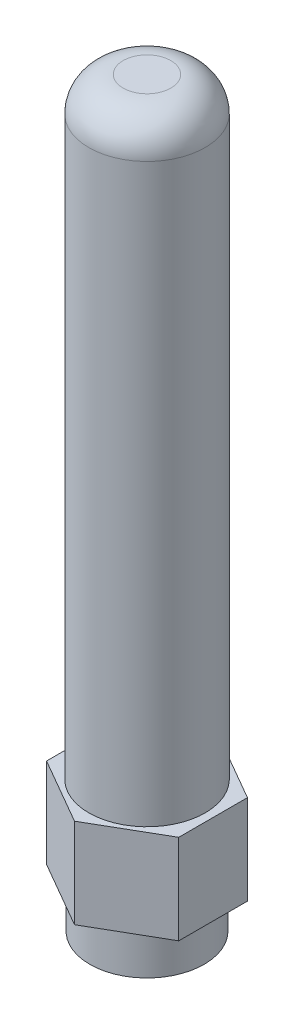
ISO-10303-21;
HEADER;
FILE_DESCRIPTION(('STEP AP214'),'2;1');
FILE_NAME('part.step','',(''),(''),'','','');
FILE_SCHEMA(('AUTOMOTIVE_DESIGN { 1 0 10303 214 1 1 1 1 }'));
ENDSEC;
DATA;
#1=APPLICATION_CONTEXT('core data for automotive mechanical design processes');
#2=APPLICATION_PROTOCOL_DEFINITION('international standard','automotive_design',2000,#1);
#3=PRODUCT_CONTEXT('',#1,'mechanical');
#4=PRODUCT('Part','Part','',(#3));
#5=PRODUCT_RELATED_PRODUCT_CATEGORY('part','',(#4));
#6=PRODUCT_DEFINITION_FORMATION('','',#4);
#7=PRODUCT_DEFINITION_CONTEXT('part definition',#1,'design');
#8=PRODUCT_DEFINITION('design','',#6,#7);
#9=PRODUCT_DEFINITION_SHAPE('','',#8);
#10=(LENGTH_UNIT() NAMED_UNIT(*) SI_UNIT(.MILLI.,.METRE.));
#11=(NAMED_UNIT(*) PLANE_ANGLE_UNIT() SI_UNIT($,.RADIAN.));
#12=(NAMED_UNIT(*) SI_UNIT($,.STERADIAN.) SOLID_ANGLE_UNIT());
#13=UNCERTAINTY_MEASURE_WITH_UNIT(LENGTH_MEASURE(1.E-05),#10,'distance_accuracy_value','');
#14=(GEOMETRIC_REPRESENTATION_CONTEXT(3) GLOBAL_UNCERTAINTY_ASSIGNED_CONTEXT((#13)) GLOBAL_UNIT_ASSIGNED_CONTEXT((#10,
#11,#12)) REPRESENTATION_CONTEXT('',''));
#15=CARTESIAN_POINT('',(0.,0.,0.));
#16=DIRECTION('',(0.,0.,1.));
#17=DIRECTION('',(1.,0.,0.));
#18=AXIS2_PLACEMENT_3D('',#15,#16,#17);
#19=CARTESIAN_POINT('',(0.,0.,0.));
#20=DIRECTION('',(0.,1.,0.));
#21=DIRECTION('',(0.,0.,1.));
#22=AXIS2_PLACEMENT_3D('',#19,#20,#21);
#23=PLANE('',#22);
#24=CARTESIAN_POINT('',(0.,0.,0.));
#25=DIRECTION('',(0.,1.,0.));
#26=DIRECTION('',(0.,0.,1.));
#27=AXIS2_PLACEMENT_3D('',#24,#25,#26);
#28=CIRCLE('',#27,3.81);
#29=CARTESIAN_POINT('',(0.,0.,3.81));
#30=VERTEX_POINT('',#29);
#31=EDGE_CURVE('E160',#30,#30,#28,.T.);
#32=ORIENTED_EDGE('',*,*,#31,.F.);
#33=EDGE_LOOP('',(#32));
#34=FACE_BOUND('',#33,.T.);
#35=CARTESIAN_POINT('',(0.,0.,0.));
#36=DIRECTION('',(0.,1.,0.));
#37=DIRECTION('',(0.,0.,1.));
#38=AXIS2_PLACEMENT_3D('',#35,#36,#37);
#39=CIRCLE('',#38,2.667);
#40=CARTESIAN_POINT('',(0.,0.,2.667));
#41=VERTEX_POINT('',#40);
#42=EDGE_CURVE('E157',#41,#41,#39,.T.);
#43=ORIENTED_EDGE('',*,*,#42,.T.);
#44=EDGE_LOOP('',(#43));
#45=FACE_BOUND('',#44,.T.);
#46=ADVANCED_FACE('F49',(#34,#45),#23,.F.);
#47=CARTESIAN_POINT('',(0.,2.794,0.));
#48=DIRECTION('',(0.,-1.,0.));
#49=DIRECTION('',(0.,0.,-1.));
#50=AXIS2_PLACEMENT_3D('',#47,#48,#49);
#51=CYLINDRICAL_SURFACE('',#50,3.81);
#52=CARTESIAN_POINT('',(0.,2.794,0.));
#53=DIRECTION('',(0.,1.,0.));
#54=DIRECTION('',(0.,0.,1.));
#55=AXIS2_PLACEMENT_3D('',#52,#53,#54);
#56=CIRCLE('',#55,3.81);
#57=CARTESIAN_POINT('',(0.,2.794,3.81));
#58=VERTEX_POINT('',#57);
#59=EDGE_CURVE('E161',#58,#58,#56,.T.);
#60=ORIENTED_EDGE('',*,*,#59,.F.);
#61=EDGE_LOOP('',(#60));
#62=FACE_BOUND('',#61,.T.);
#63=ORIENTED_EDGE('',*,*,#31,.T.);
#64=EDGE_LOOP('',(#63));
#65=FACE_BOUND('',#64,.T.);
#66=ADVANCED_FACE('F198',(#62,#65),#51,.T.);
#67=CARTESIAN_POINT('',(0.,2.794,0.));
#68=DIRECTION('',(0.,-1.,0.));
#69=DIRECTION('',(0.,0.,-1.));
#70=AXIS2_PLACEMENT_3D('',#67,#68,#69);
#71=CYLINDRICAL_SURFACE('',#70,2.667);
#72=CARTESIAN_POINT('',(0.,2.794,0.));
#73=DIRECTION('',(0.,1.,0.));
#74=DIRECTION('',(0.,0.,1.));
#75=AXIS2_PLACEMENT_3D('',#72,#73,#74);
#76=CIRCLE('',#75,2.667);
#77=CARTESIAN_POINT('',(0.,2.794,2.667));
#78=VERTEX_POINT('',#77);
#79=EDGE_CURVE('E154',#78,#78,#76,.T.);
#80=ORIENTED_EDGE('',*,*,#79,.T.);
#81=EDGE_LOOP('',(#80));
#82=FACE_BOUND('',#81,.T.);
#83=ORIENTED_EDGE('',*,*,#42,.F.);
#84=EDGE_LOOP('',(#83));
#85=FACE_BOUND('',#84,.T.);
#86=ADVANCED_FACE('F204',(#82,#85),#71,.F.);
#87=CARTESIAN_POINT('',(0.,2.794,0.));
#88=DIRECTION('',(0.,1.,0.));
#89=DIRECTION('',(0.,0.,1.));
#90=AXIS2_PLACEMENT_3D('',#87,#88,#89);
#91=PLANE('',#90);
#92=ORIENTED_EDGE('',*,*,#79,.F.);
#93=EDGE_LOOP('',(#92));
#94=FACE_BOUND('',#93,.T.);
#95=ADVANCED_FACE('F211',(#94),#91,.F.);
#96=CARTESIAN_POINT('',(-4.39940905122496,8.763,-2.286));
#97=DIRECTION('',(0.499999999999998,0.,0.86602540378444));
#98=DIRECTION('',(0.86602540378444,0.,-0.499999999999998));
#99=AXIS2_PLACEMENT_3D('',#96,#97,#98);
#100=PLANE('',#99);
#101=DIRECTION('',(-0.86602540378444,0.,0.499999999999998));
#102=VECTOR('',#101,1.);
#103=CARTESIAN_POINT('',(-4.39940905122496,2.794,-2.286));
#104=LINE('',#103,#102);
#105=CARTESIAN_POINT('',(0.,2.794,-4.82599999999999));
#106=VERTEX_POINT('',#105);
#107=CARTESIAN_POINT('',(-4.39940905122496,2.794,-2.286));
#108=VERTEX_POINT('',#107);
#109=EDGE_CURVE('E135',#106,#108,#104,.T.);
#110=ORIENTED_EDGE('',*,*,#109,.T.);
#111=DIRECTION('',(0.,-1.,0.));
#112=VECTOR('',#111,1.);
#113=CARTESIAN_POINT('',(-4.39940905122496,8.763,-2.286));
#114=LINE('',#113,#112);
#115=CARTESIAN_POINT('',(-4.39940905122496,8.763,-2.286));
#116=VERTEX_POINT('',#115);
#117=EDGE_CURVE('E152',#116,#108,#114,.T.);
#118=ORIENTED_EDGE('',*,*,#117,.F.);
#119=DIRECTION('',(-0.86602540378444,0.,0.499999999999998));
#120=VECTOR('',#119,1.);
#121=CARTESIAN_POINT('',(-4.39940905122496,8.763,-2.286));
#122=LINE('',#121,#120);
#123=CARTESIAN_POINT('',(0.,8.763,-4.82599999999999));
#124=VERTEX_POINT('',#123);
#125=EDGE_CURVE('E145',#124,#116,#122,.T.);
#126=ORIENTED_EDGE('',*,*,#125,.F.);
#127=DIRECTION('',(0.,-1.,0.));
#128=VECTOR('',#127,1.);
#129=CARTESIAN_POINT('',(0.,8.763,-4.82599999999999));
#130=LINE('',#129,#128);
#131=EDGE_CURVE('E131',#124,#106,#130,.T.);
#132=ORIENTED_EDGE('',*,*,#131,.T.);
#133=EDGE_LOOP('',(#110,#118,#126,#132));
#134=FACE_BOUND('',#133,.T.);
#135=ADVANCED_FACE('F185',(#134),#100,.F.);
#136=CARTESIAN_POINT('',(-4.39940905122496,8.763,2.286));
#137=DIRECTION('',(1.,0.,0.));
#138=DIRECTION('',(0.,0.,-1.));
#139=AXIS2_PLACEMENT_3D('',#136,#137,#138);
#140=PLANE('',#139);
#141=DIRECTION('',(0.,0.,1.));
#142=VECTOR('',#141,1.);
#143=CARTESIAN_POINT('',(-4.39940905122496,2.794,2.286));
#144=LINE('',#143,#142);
#145=CARTESIAN_POINT('',(-4.39940905122496,2.794,2.286));
#146=VERTEX_POINT('',#145);
#147=EDGE_CURVE('E138',#108,#146,#144,.T.);
#148=ORIENTED_EDGE('',*,*,#147,.T.);
#149=DIRECTION('',(0.,-1.,0.));
#150=VECTOR('',#149,1.);
#151=CARTESIAN_POINT('',(-4.39940905122496,8.763,2.286));
#152=LINE('',#151,#150);
#153=CARTESIAN_POINT('',(-4.39940905122496,8.763,2.286));
#154=VERTEX_POINT('',#153);
#155=EDGE_CURVE('E149',#154,#146,#152,.T.);
#156=ORIENTED_EDGE('',*,*,#155,.F.);
#157=DIRECTION('',(0.,0.,1.));
#158=VECTOR('',#157,1.);
#159=CARTESIAN_POINT('',(-4.39940905122496,8.763,2.286));
#160=LINE('',#159,#158);
#161=EDGE_CURVE('E104',#116,#154,#160,.T.);
#162=ORIENTED_EDGE('',*,*,#161,.F.);
#163=ORIENTED_EDGE('',*,*,#117,.T.);
#164=EDGE_LOOP('',(#148,#156,#162,#163));
#165=FACE_BOUND('',#164,.T.);
#166=ADVANCED_FACE('F177',(#165),#140,.F.);
#167=CARTESIAN_POINT('',(-4.39940905122496,8.763,2.286));
#168=DIRECTION('',(0.499999999999998,0.,-0.86602540378444));
#169=DIRECTION('',(-0.86602540378444,0.,-0.499999999999998));
#170=AXIS2_PLACEMENT_3D('',#167,#168,#169);
#171=PLANE('',#170);
#172=DIRECTION('',(0.86602540378444,0.,0.499999999999998));
#173=VECTOR('',#172,1.);
#174=CARTESIAN_POINT('',(-4.39940905122496,2.794,2.286));
#175=LINE('',#174,#173);
#176=CARTESIAN_POINT('',(0.,2.794,4.82599999999999));
#177=VERTEX_POINT('',#176);
#178=EDGE_CURVE('E140',#146,#177,#175,.T.);
#179=ORIENTED_EDGE('',*,*,#178,.T.);
#180=DIRECTION('',(0.,-1.,0.));
#181=VECTOR('',#180,1.);
#182=CARTESIAN_POINT('',(0.,8.763,4.82599999999999));
#183=LINE('',#182,#181);
#184=CARTESIAN_POINT('',(0.,8.763,4.82599999999999));
#185=VERTEX_POINT('',#184);
#186=EDGE_CURVE('E126',#185,#177,#183,.T.);
#187=ORIENTED_EDGE('',*,*,#186,.F.);
#188=DIRECTION('',(0.86602540378444,0.,0.499999999999998));
#189=VECTOR('',#188,1.);
#190=CARTESIAN_POINT('',(-4.39940905122496,8.763,2.286));
#191=LINE('',#190,#189);
#192=EDGE_CURVE('E117',#154,#185,#191,.T.);
#193=ORIENTED_EDGE('',*,*,#192,.F.);
#194=ORIENTED_EDGE('',*,*,#155,.T.);
#195=EDGE_LOOP('',(#179,#187,#193,#194));
#196=FACE_BOUND('',#195,.T.);
#197=ADVANCED_FACE('F180',(#196),#171,.F.);
#198=CARTESIAN_POINT('',(4.39940905122496,8.763,2.286));
#199=DIRECTION('',(-0.499999999999998,0.,-0.86602540378444));
#200=DIRECTION('',(-0.86602540378444,0.,0.499999999999998));
#201=AXIS2_PLACEMENT_3D('',#198,#199,#200);
#202=PLANE('',#201);
#203=DIRECTION('',(0.86602540378444,0.,-0.499999999999998));
#204=VECTOR('',#203,1.);
#205=CARTESIAN_POINT('',(4.39940905122496,2.794,2.286));
#206=LINE('',#205,#204);
#207=CARTESIAN_POINT('',(4.39940905122496,2.794,2.286));
#208=VERTEX_POINT('',#207);
#209=EDGE_CURVE('E125',#177,#208,#206,.T.);
#210=ORIENTED_EDGE('',*,*,#209,.T.);
#211=DIRECTION('',(0.,-1.,0.));
#212=VECTOR('',#211,1.);
#213=CARTESIAN_POINT('',(4.39940905122496,8.763,2.286));
#214=LINE('',#213,#212);
#215=CARTESIAN_POINT('',(4.39940905122496,8.763,2.286));
#216=VERTEX_POINT('',#215);
#217=EDGE_CURVE('E122',#216,#208,#214,.T.);
#218=ORIENTED_EDGE('',*,*,#217,.F.);
#219=DIRECTION('',(0.86602540378444,0.,-0.499999999999998));
#220=VECTOR('',#219,1.);
#221=CARTESIAN_POINT('',(4.39940905122496,8.763,2.286));
#222=LINE('',#221,#220);
#223=EDGE_CURVE('E111',#185,#216,#222,.T.);
#224=ORIENTED_EDGE('',*,*,#223,.F.);
#225=ORIENTED_EDGE('',*,*,#186,.T.);
#226=EDGE_LOOP('',(#210,#218,#224,#225));
#227=FACE_BOUND('',#226,.T.);
#228=ADVANCED_FACE('F123',(#227),#202,.F.);
#229=CARTESIAN_POINT('',(4.39940905122496,8.763,2.286));
#230=DIRECTION('',(-1.,0.,0.));
#231=DIRECTION('',(0.,0.,1.));
#232=AXIS2_PLACEMENT_3D('',#229,#230,#231);
#233=PLANE('',#232);
#234=DIRECTION('',(0.,0.,-1.));
#235=VECTOR('',#234,1.);
#236=CARTESIAN_POINT('',(4.39940905122496,2.794,2.286));
#237=LINE('',#236,#235);
#238=CARTESIAN_POINT('',(4.39940905122496,2.794,-2.286));
#239=VERTEX_POINT('',#238);
#240=EDGE_CURVE('E89',#208,#239,#237,.T.);
#241=ORIENTED_EDGE('',*,*,#240,.T.);
#242=DIRECTION('',(0.,-1.,0.));
#243=VECTOR('',#242,1.);
#244=CARTESIAN_POINT('',(4.39940905122496,8.763,-2.286));
#245=LINE('',#244,#243);
#246=CARTESIAN_POINT('',(4.39940905122496,8.763,-2.286));
#247=VERTEX_POINT('',#246);
#248=EDGE_CURVE('E127',#247,#239,#245,.T.);
#249=ORIENTED_EDGE('',*,*,#248,.F.);
#250=DIRECTION('',(0.,0.,-1.));
#251=VECTOR('',#250,1.);
#252=CARTESIAN_POINT('',(4.39940905122496,8.763,2.286));
#253=LINE('',#252,#251);
#254=EDGE_CURVE('E115',#216,#247,#253,.T.);
#255=ORIENTED_EDGE('',*,*,#254,.F.);
#256=ORIENTED_EDGE('',*,*,#217,.T.);
#257=EDGE_LOOP('',(#241,#249,#255,#256));
#258=FACE_BOUND('',#257,.T.);
#259=ADVANCED_FACE('F129',(#258),#233,.F.);
#260=CARTESIAN_POINT('',(4.39940905122496,8.763,-2.286));
#261=DIRECTION('',(-0.499999999999998,0.,0.86602540378444));
#262=DIRECTION('',(0.86602540378444,0.,0.499999999999998));
#263=AXIS2_PLACEMENT_3D('',#260,#261,#262);
#264=PLANE('',#263);
#265=DIRECTION('',(-0.86602540378444,0.,-0.499999999999998));
#266=VECTOR('',#265,1.);
#267=CARTESIAN_POINT('',(4.39940905122496,2.794,-2.286));
#268=LINE('',#267,#266);
#269=EDGE_CURVE('E95',#239,#106,#268,.T.);
#270=ORIENTED_EDGE('',*,*,#269,.T.);
#271=ORIENTED_EDGE('',*,*,#131,.F.);
#272=DIRECTION('',(-0.86602540378444,0.,-0.499999999999998));
#273=VECTOR('',#272,1.);
#274=CARTESIAN_POINT('',(4.39940905122496,8.763,-2.286));
#275=LINE('',#274,#273);
#276=EDGE_CURVE('E66',#247,#124,#275,.T.);
#277=ORIENTED_EDGE('',*,*,#276,.F.);
#278=ORIENTED_EDGE('',*,*,#248,.T.);
#279=EDGE_LOOP('',(#270,#271,#277,#278));
#280=FACE_BOUND('',#279,.T.);
#281=ADVANCED_FACE('F186',(#280),#264,.F.);
#282=CARTESIAN_POINT('',(0.,8.763,0.));
#283=DIRECTION('',(0.,1.,0.));
#284=DIRECTION('',(0.,0.,1.));
#285=AXIS2_PLACEMENT_3D('',#282,#283,#284);
#286=PLANE('',#285);
#287=CARTESIAN_POINT('',(0.,8.763,0.));
#288=DIRECTION('',(0.,1.,0.));
#289=DIRECTION('',(0.,0.,1.));
#290=AXIS2_PLACEMENT_3D('',#287,#288,#289);
#291=CIRCLE('',#290,3.8735);
#292=CARTESIAN_POINT('',(0.,8.763,3.8735));
#293=VERTEX_POINT('',#292);
#294=EDGE_CURVE('E164',#293,#293,#291,.T.);
#295=ORIENTED_EDGE('',*,*,#294,.F.);
#296=EDGE_LOOP('',(#295));
#297=FACE_BOUND('',#296,.T.);
#298=ORIENTED_EDGE('',*,*,#125,.T.);
#299=ORIENTED_EDGE('',*,*,#161,.T.);
#300=ORIENTED_EDGE('',*,*,#192,.T.);
#301=ORIENTED_EDGE('',*,*,#223,.T.);
#302=ORIENTED_EDGE('',*,*,#254,.T.);
#303=ORIENTED_EDGE('',*,*,#276,.T.);
#304=EDGE_LOOP('',(#298,#299,#300,#301,#302,#303));
#305=FACE_BOUND('',#304,.T.);
#306=ADVANCED_FACE('F113',(#297,#305),#286,.T.);
#307=ORIENTED_EDGE('',*,*,#59,.T.);
#308=EDGE_LOOP('',(#307));
#309=FACE_BOUND('',#308,.T.);
#310=ORIENTED_EDGE('',*,*,#109,.F.);
#311=ORIENTED_EDGE('',*,*,#269,.F.);
#312=ORIENTED_EDGE('',*,*,#240,.F.);
#313=ORIENTED_EDGE('',*,*,#209,.F.);
#314=ORIENTED_EDGE('',*,*,#178,.F.);
#315=ORIENTED_EDGE('',*,*,#147,.F.);
#316=EDGE_LOOP('',(#310,#311,#312,#313,#314,#315));
#317=FACE_BOUND('',#316,.T.);
#318=ADVANCED_FACE('F183',(#309,#317),#91,.F.);
#319=CARTESIAN_POINT('',(0.,49.403,0.));
#320=DIRECTION('',(0.,-1.,0.));
#321=DIRECTION('',(0.,0.,-1.));
#322=AXIS2_PLACEMENT_3D('',#319,#320,#321);
#323=CYLINDRICAL_SURFACE('',#322,3.8735);
#324=CARTESIAN_POINT('',(0.,47.117,0.));
#325=DIRECTION('',(0.,1.,0.));
#326=DIRECTION('',(0.,0.,1.));
#327=AXIS2_PLACEMENT_3D('',#324,#325,#326);
#328=CIRCLE('',#327,3.8735);
#329=CARTESIAN_POINT('',(0.,47.117,3.8735));
#330=VERTEX_POINT('',#329);
#331=EDGE_CURVE('E11',#330,#330,#328,.F.);
#332=ORIENTED_EDGE('',*,*,#331,.T.);
#333=EDGE_LOOP('',(#332));
#334=FACE_BOUND('',#333,.T.);
#335=ORIENTED_EDGE('',*,*,#294,.T.);
#336=EDGE_LOOP('',(#335));
#337=FACE_BOUND('',#336,.T.);
#338=ADVANCED_FACE('F248',(#334,#337),#323,.T.);
#339=CARTESIAN_POINT('',(0.,49.403,0.));
#340=DIRECTION('',(0.,1.,0.));
#341=DIRECTION('',(0.,0.,1.));
#342=AXIS2_PLACEMENT_3D('',#339,#340,#341);
#343=PLANE('',#342);
#344=CARTESIAN_POINT('',(0.,49.403,0.));
#345=DIRECTION('',(0.,1.,0.));
#346=DIRECTION('',(0.,0.,1.));
#347=AXIS2_PLACEMENT_3D('',#344,#345,#346);
#348=CIRCLE('',#347,1.5875);
#349=CARTESIAN_POINT('',(0.,49.403,1.5875));
#350=VERTEX_POINT('',#349);
#351=EDGE_CURVE('E58',#350,#350,#348,.T.);
#352=ORIENTED_EDGE('',*,*,#351,.T.);
#353=EDGE_LOOP('',(#352));
#354=FACE_BOUND('',#353,.T.);
#355=ADVANCED_FACE('F256',(#354),#343,.T.);
#356=CARTESIAN_POINT('',(0.,47.117,0.));
#357=DIRECTION('',(0.,1.,0.));
#358=DIRECTION('',(0.,0.,1.));
#359=AXIS2_PLACEMENT_3D('',#356,#357,#358);
#360=DEGENERATE_TOROIDAL_SURFACE('',#359,1.5875,2.286,.T.);
#361=ORIENTED_EDGE('',*,*,#331,.F.);
#362=EDGE_LOOP('',(#361));
#363=FACE_BOUND('',#362,.T.);
#364=ORIENTED_EDGE('',*,*,#351,.F.);
#365=EDGE_LOOP('',(#364));
#366=FACE_BOUND('',#365,.T.);
#367=ADVANCED_FACE('F51',(#363,#366),#360,.T.);
#368=CLOSED_SHELL('',(#46,#66,#86,#95,#135,#166,#197,#228,#259,#281,#306,#318,#338,#355,#367));
#369=MANIFOLD_SOLID_BREP('B2',#368);
#370=ADVANCED_BREP_SHAPE_REPRESENTATION('',(#18,#369),#14);
#371=SHAPE_DEFINITION_REPRESENTATION(#9,#370);
ENDSEC;
END-ISO-10303-21;
